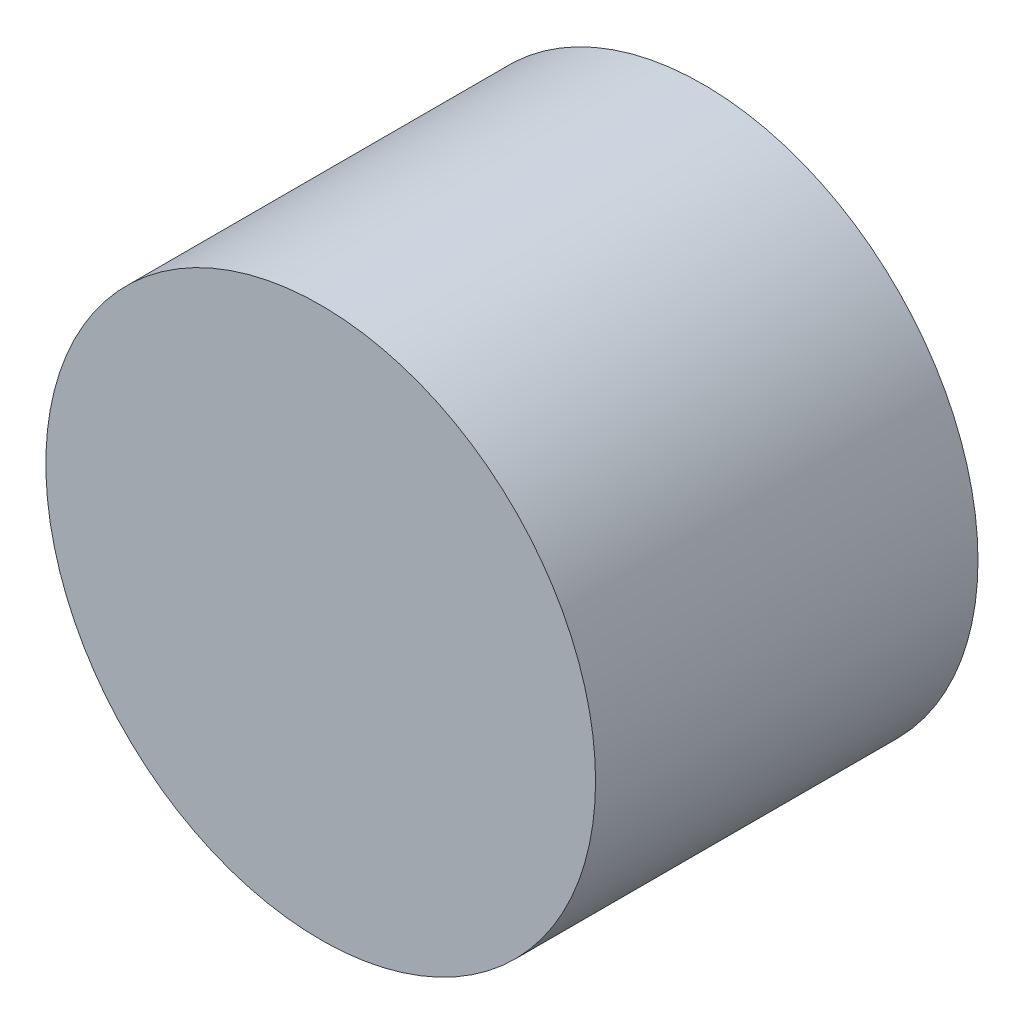
ISO-10303-21;
HEADER;
FILE_DESCRIPTION(('STEP AP214'),'2;1');
FILE_NAME('part.step','',(''),(''),'','','');
FILE_SCHEMA(('AUTOMOTIVE_DESIGN { 1 0 10303 214 1 1 1 1 }'));
ENDSEC;
DATA;
#1=APPLICATION_CONTEXT('core data for automotive mechanical design processes');
#2=APPLICATION_PROTOCOL_DEFINITION('international standard','automotive_design',2000,#1);
#3=PRODUCT_CONTEXT('',#1,'mechanical');
#4=PRODUCT('Part','Part','',(#3));
#5=PRODUCT_RELATED_PRODUCT_CATEGORY('part','',(#4));
#6=PRODUCT_DEFINITION_FORMATION('','',#4);
#7=PRODUCT_DEFINITION_CONTEXT('part definition',#1,'design');
#8=PRODUCT_DEFINITION('design','',#6,#7);
#9=PRODUCT_DEFINITION_SHAPE('','',#8);
#10=(LENGTH_UNIT() NAMED_UNIT(*) SI_UNIT(.MILLI.,.METRE.));
#11=(NAMED_UNIT(*) PLANE_ANGLE_UNIT() SI_UNIT($,.RADIAN.));
#12=(NAMED_UNIT(*) SI_UNIT($,.STERADIAN.) SOLID_ANGLE_UNIT());
#13=UNCERTAINTY_MEASURE_WITH_UNIT(LENGTH_MEASURE(1.E-05),#10,'distance_accuracy_value','');
#14=(GEOMETRIC_REPRESENTATION_CONTEXT(3) GLOBAL_UNCERTAINTY_ASSIGNED_CONTEXT((#13)) GLOBAL_UNIT_ASSIGNED_CONTEXT((#10,
#11,#12)) REPRESENTATION_CONTEXT('',''));
#15=CARTESIAN_POINT('',(0.,0.,0.));
#16=DIRECTION('',(0.,0.,1.));
#17=DIRECTION('',(1.,0.,0.));
#18=AXIS2_PLACEMENT_3D('',#15,#16,#17);
#19=CARTESIAN_POINT('',(0.,0.,25.4));
#20=DIRECTION('',(0.,0.,-1.));
#21=DIRECTION('',(-1.,0.,0.));
#22=AXIS2_PLACEMENT_3D('',#19,#20,#21);
#23=CYLINDRICAL_SURFACE('',#22,18.25625);
#24=CARTESIAN_POINT('',(0.,0.,25.4));
#25=DIRECTION('',(0.,0.,1.));
#26=DIRECTION('',(1.,0.,0.));
#27=AXIS2_PLACEMENT_3D('',#24,#25,#26);
#28=CIRCLE('',#27,18.25625);
#29=CARTESIAN_POINT('',(18.25625,0.,25.4));
#30=VERTEX_POINT('',#29);
#31=EDGE_CURVE('E10',#30,#30,#28,.T.);
#32=ORIENTED_EDGE('',*,*,#31,.F.);
#33=EDGE_LOOP('',(#32));
#34=FACE_BOUND('',#33,.T.);
#35=CARTESIAN_POINT('',(0.,0.,0.));
#36=DIRECTION('',(0.,0.,1.));
#37=DIRECTION('',(1.,0.,0.));
#38=AXIS2_PLACEMENT_3D('',#35,#36,#37);
#39=CIRCLE('',#38,18.25625);
#40=CARTESIAN_POINT('',(18.25625,0.,0.));
#41=VERTEX_POINT('',#40);
#42=EDGE_CURVE('E33',#41,#41,#39,.T.);
#43=ORIENTED_EDGE('',*,*,#42,.T.);
#44=EDGE_LOOP('',(#43));
#45=FACE_BOUND('',#44,.T.);
#46=ADVANCED_FACE('F30',(#34,#45),#23,.T.);
#47=CARTESIAN_POINT('',(0.,0.,25.4));
#48=DIRECTION('',(0.,0.,1.));
#49=DIRECTION('',(1.,0.,0.));
#50=AXIS2_PLACEMENT_3D('',#47,#48,#49);
#51=PLANE('',#50);
#52=ORIENTED_EDGE('',*,*,#31,.T.);
#53=EDGE_LOOP('',(#52));
#54=FACE_BOUND('',#53,.T.);
#55=ADVANCED_FACE('F45',(#54),#51,.T.);
#56=CARTESIAN_POINT('',(0.,0.,0.));
#57=DIRECTION('',(0.,0.,1.));
#58=DIRECTION('',(1.,0.,0.));
#59=AXIS2_PLACEMENT_3D('',#56,#57,#58);
#60=PLANE('',#59);
#61=ORIENTED_EDGE('',*,*,#42,.F.);
#62=EDGE_LOOP('',(#61));
#63=FACE_BOUND('',#62,.T.);
#64=ADVANCED_FACE('F43',(#63),#60,.F.);
#65=CLOSED_SHELL('',(#46,#55,#64));
#66=MANIFOLD_SOLID_BREP('B2',#65);
#67=ADVANCED_BREP_SHAPE_REPRESENTATION('',(#18,#66),#14);
#68=SHAPE_DEFINITION_REPRESENTATION(#9,#67);
ENDSEC;
END-ISO-10303-21;
